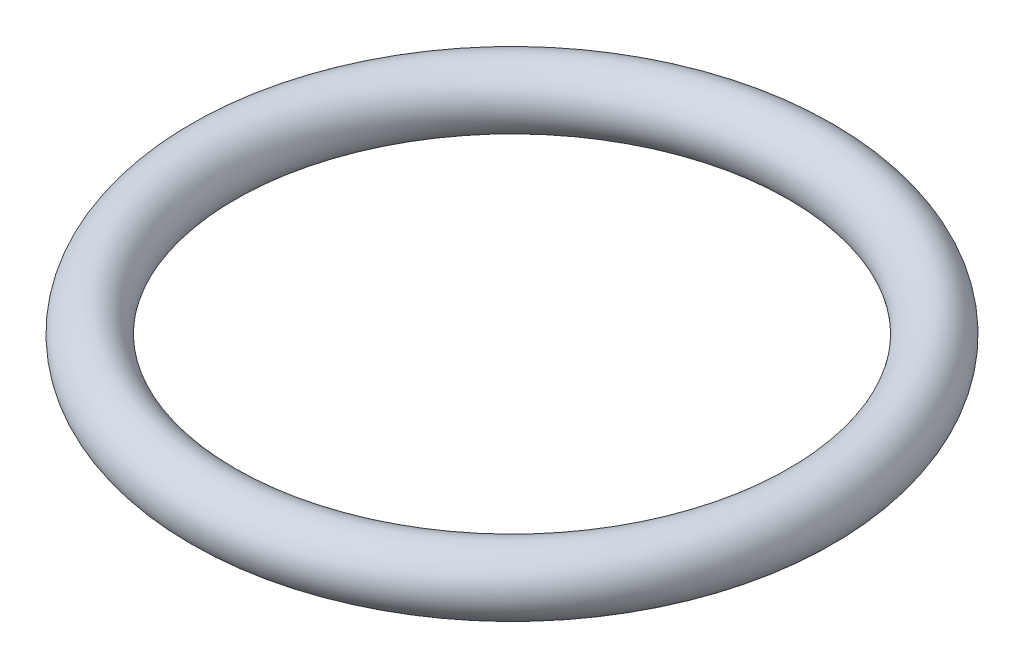
ISO-10303-21;
HEADER;
FILE_DESCRIPTION(('STEP AP214'),'2;1');
FILE_NAME('part.step','',(''),(''),'','','');
FILE_SCHEMA(('AUTOMOTIVE_DESIGN { 1 0 10303 214 1 1 1 1 }'));
ENDSEC;
DATA;
#1=APPLICATION_CONTEXT('core data for automotive mechanical design processes');
#2=APPLICATION_PROTOCOL_DEFINITION('international standard','automotive_design',2000,#1);
#3=PRODUCT_CONTEXT('',#1,'mechanical');
#4=PRODUCT('Part','Part','',(#3));
#5=PRODUCT_RELATED_PRODUCT_CATEGORY('part','',(#4));
#6=PRODUCT_DEFINITION_FORMATION('','',#4);
#7=PRODUCT_DEFINITION_CONTEXT('part definition',#1,'design');
#8=PRODUCT_DEFINITION('design','',#6,#7);
#9=PRODUCT_DEFINITION_SHAPE('','',#8);
#10=(LENGTH_UNIT() NAMED_UNIT(*) SI_UNIT(.MILLI.,.METRE.));
#11=(NAMED_UNIT(*) PLANE_ANGLE_UNIT() SI_UNIT($,.RADIAN.));
#12=(NAMED_UNIT(*) SI_UNIT($,.STERADIAN.) SOLID_ANGLE_UNIT());
#13=UNCERTAINTY_MEASURE_WITH_UNIT(LENGTH_MEASURE(1.E-05),#10,'distance_accuracy_value','');
#14=(GEOMETRIC_REPRESENTATION_CONTEXT(3) GLOBAL_UNCERTAINTY_ASSIGNED_CONTEXT((#13)) GLOBAL_UNIT_ASSIGNED_CONTEXT((#10,
#11,#12)) REPRESENTATION_CONTEXT('',''));
#15=CARTESIAN_POINT('',(0.,0.,0.));
#16=DIRECTION('',(0.,0.,1.));
#17=DIRECTION('',(1.,0.,0.));
#18=AXIS2_PLACEMENT_3D('',#15,#16,#17);
#19=CARTESIAN_POINT('',(0.,0.,0.));
#20=DIRECTION('',(0.,-1.,0.));
#21=DIRECTION('',(0.,0.,-1.));
#22=AXIS2_PLACEMENT_3D('',#19,#20,#21);
#23=TOROIDAL_SURFACE('',#22,8.585,0.888999999999999);
#24=CARTESIAN_POINT('',(0.,0.,-9.474));
#25=VERTEX_POINT('',#24);
#26=VERTEX_LOOP('',#25);
#27=FACE_BOUND('',#26,.T.);
#28=ADVANCED_FACE('F29',(#27),#23,.T.);
#29=CLOSED_SHELL('',(#28));
#30=MANIFOLD_SOLID_BREP('B2',#29);
#31=ADVANCED_BREP_SHAPE_REPRESENTATION('',(#18,#30),#14);
#32=SHAPE_DEFINITION_REPRESENTATION(#9,#31);
ENDSEC;
END-ISO-10303-21;
